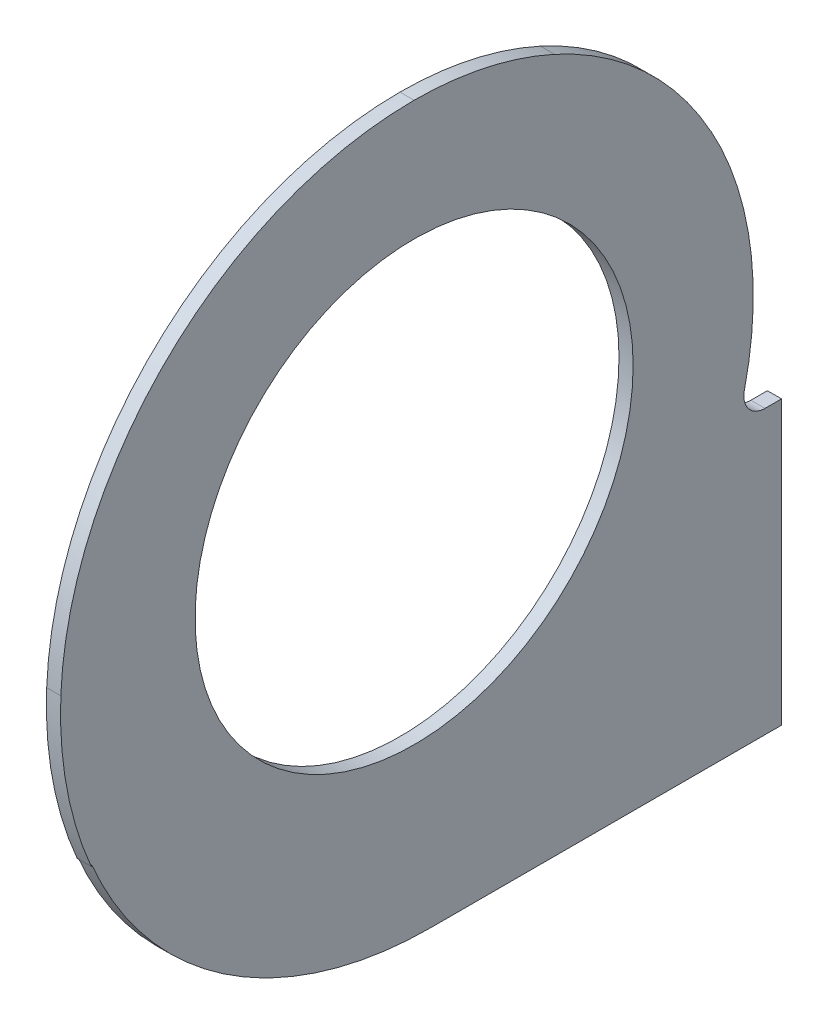
ISO-10303-21;
HEADER;
FILE_DESCRIPTION(('STEP AP214'),'2;1');
FILE_NAME('part.step','',(''),(''),'','','');
FILE_SCHEMA(('AUTOMOTIVE_DESIGN { 1 0 10303 214 1 1 1 1 }'));
ENDSEC;
DATA;
#1=APPLICATION_CONTEXT('core data for automotive mechanical design processes');
#2=APPLICATION_PROTOCOL_DEFINITION('international standard','automotive_design',2000,#1);
#3=PRODUCT_CONTEXT('',#1,'mechanical');
#4=PRODUCT('Part','Part','',(#3));
#5=PRODUCT_RELATED_PRODUCT_CATEGORY('part','',(#4));
#6=PRODUCT_DEFINITION_FORMATION('','',#4);
#7=PRODUCT_DEFINITION_CONTEXT('part definition',#1,'design');
#8=PRODUCT_DEFINITION('design','',#6,#7);
#9=PRODUCT_DEFINITION_SHAPE('','',#8);
#10=(LENGTH_UNIT() NAMED_UNIT(*) SI_UNIT(.MILLI.,.METRE.));
#11=(NAMED_UNIT(*) PLANE_ANGLE_UNIT() SI_UNIT($,.RADIAN.));
#12=(NAMED_UNIT(*) SI_UNIT($,.STERADIAN.) SOLID_ANGLE_UNIT());
#13=UNCERTAINTY_MEASURE_WITH_UNIT(LENGTH_MEASURE(1.E-05),#10,'distance_accuracy_value','');
#14=(GEOMETRIC_REPRESENTATION_CONTEXT(3) GLOBAL_UNCERTAINTY_ASSIGNED_CONTEXT((#13)) GLOBAL_UNIT_ASSIGNED_CONTEXT((#10,
#11,#12)) REPRESENTATION_CONTEXT('',''));
#15=CARTESIAN_POINT('',(0.,0.,0.));
#16=DIRECTION('',(0.,0.,1.));
#17=DIRECTION('',(1.,0.,0.));
#18=AXIS2_PLACEMENT_3D('',#15,#16,#17);
#19=CARTESIAN_POINT('',(0.,0.,-26.));
#20=DIRECTION('',(0.,0.,1.));
#21=DIRECTION('',(0.,-1.,0.));
#22=AXIS2_PLACEMENT_3D('',#19,#20,#21);
#23=PLANE('',#22);
#24=DIRECTION('',(0.,1.,0.));
#25=VECTOR('',#24,1.);
#26=CARTESIAN_POINT('',(13.5,-26.2999999999998,-26.));
#27=LINE('',#26,#25);
#28=CARTESIAN_POINT('',(13.5,-27.2999999999999,-26.));
#29=VERTEX_POINT('',#28);
#30=CARTESIAN_POINT('',(13.5,-7.29999999999976,-26.));
#31=VERTEX_POINT('',#30);
#32=EDGE_CURVE('E311',#29,#31,#27,.T.);
#33=ORIENTED_EDGE('',*,*,#32,.T.);
#34=DIRECTION('',(1.,0.,0.));
#35=VECTOR('',#34,1.);
#36=CARTESIAN_POINT('',(14.5,-7.29999999999976,-26.));
#37=LINE('',#36,#35);
#38=CARTESIAN_POINT('',(14.5,-7.29999999999976,-26.));
#39=VERTEX_POINT('',#38);
#40=EDGE_CURVE('E314',#31,#39,#37,.T.);
#41=ORIENTED_EDGE('',*,*,#40,.T.);
#42=DIRECTION('',(0.,-1.,0.));
#43=VECTOR('',#42,1.);
#44=CARTESIAN_POINT('',(14.5,-27.2999999999998,-25.9999999999999));
#45=LINE('',#44,#43);
#46=CARTESIAN_POINT('',(14.5,-27.2999999999998,-25.9999999999999));
#47=VERTEX_POINT('',#46);
#48=EDGE_CURVE('E317',#39,#47,#45,.T.);
#49=ORIENTED_EDGE('',*,*,#48,.T.);
#50=DIRECTION('',(-1.,0.,0.));
#51=VECTOR('',#50,1.);
#52=CARTESIAN_POINT('',(3.,-27.2999999999998,-25.9999999999999));
#53=LINE('',#52,#51);
#54=EDGE_CURVE('E321',#47,#29,#53,.T.);
#55=ORIENTED_EDGE('',*,*,#54,.T.);
#56=EDGE_LOOP('',(#33,#41,#49,#55));
#57=FACE_BOUND('',#56,.T.);
#58=ADVANCED_FACE('F38',(#57),#23,.F.);
#59=CARTESIAN_POINT('',(3.,-1.07015999999986,-1.20799999999999));
#60=DIRECTION('',(1.,0.,0.));
#61=DIRECTION('',(0.,0.,-1.));
#62=AXIS2_PLACEMENT_3D('',#59,#60,#61);
#63=CYLINDRICAL_SURFACE('',#62,26.22984);
#64=CARTESIAN_POINT('',(14.5,-24.722503320528,10.130922429996));
#65=DIRECTION('',(-1.,0.,0.));
#66=VECTOR('',#65,1.);
#67=LINE('',#64,#66);
#68=CARTESIAN_POINT('',(14.5,-24.7224797385234,10.1308919924631));
#69=VERTEX_POINT('',#68);
#70=CARTESIAN_POINT('',(13.5,-24.7224797385234,10.1308919924631));
#71=VERTEX_POINT('',#70);
#72=EDGE_CURVE('E190',#69,#71,#67,.T.);
#73=ORIENTED_EDGE('',*,*,#72,.T.);
#74=CARTESIAN_POINT('',(13.5,-1.07015999999986,-1.20799999999999));
#75=DIRECTION('',(-1.,0.,0.));
#76=DIRECTION('',(0.,0.,1.));
#77=AXIS2_PLACEMENT_3D('',#74,#75,#76);
#78=CIRCLE('',#77,26.22984);
#79=CARTESIAN_POINT('',(13.5,-27.2999999999999,-1.20799999999976));
#80=VERTEX_POINT('',#79);
#81=EDGE_CURVE('E214',#71,#80,#78,.F.);
#82=ORIENTED_EDGE('',*,*,#81,.T.);
#83=DIRECTION('',(1.,0.,0.));
#84=VECTOR('',#83,1.);
#85=CARTESIAN_POINT('',(3.,-27.2999999999999,-1.208));
#86=LINE('',#85,#84);
#87=CARTESIAN_POINT('',(14.5,-27.2999999999999,-1.208));
#88=VERTEX_POINT('',#87);
#89=EDGE_CURVE('E227',#80,#88,#86,.T.);
#90=ORIENTED_EDGE('',*,*,#89,.T.);
#91=CARTESIAN_POINT('',(14.5,-1.07015999999986,-1.20799999999999));
#92=DIRECTION('',(1.,0.,0.));
#93=DIRECTION('',(0.,0.,-1.));
#94=AXIS2_PLACEMENT_3D('',#91,#92,#93);
#95=CIRCLE('',#94,26.22984);
#96=EDGE_CURVE('E223',#69,#88,#95,.T.);
#97=ORIENTED_EDGE('',*,*,#96,.F.);
#98=EDGE_LOOP('',(#73,#82,#90,#97));
#99=FACE_BOUND('',#98,.T.);
#100=ADVANCED_FACE('F334',(#99),#63,.T.);
#101=CARTESIAN_POINT('',(3.,-1.07015999999986,-1.20799999999999));
#102=DIRECTION('',(1.,0.,0.));
#103=DIRECTION('',(0.,0.,-1.));
#104=AXIS2_PLACEMENT_3D('',#101,#102,#103);
#105=CYLINDRICAL_SURFACE('',#104,26.22984);
#106=DIRECTION('',(1.,0.,0.));
#107=VECTOR('',#106,1.);
#108=CARTESIAN_POINT('',(3.,-11.5328664623184,22.8447811262848));
#109=LINE('',#108,#107);
#110=CARTESIAN_POINT('',(14.5,-11.5328664623184,22.8447811262848));
#111=VERTEX_POINT('',#110);
#112=CARTESIAN_POINT('',(13.5,-11.5328664623184,22.8447811262848));
#113=VERTEX_POINT('',#112);
#114=EDGE_CURVE('E65',#111,#113,#109,.F.);
#115=ORIENTED_EDGE('',*,*,#114,.F.);
#116=CARTESIAN_POINT('',(14.5,-1.07015999999986,-1.20799999999999));
#117=DIRECTION('',(1.,0.,0.));
#118=DIRECTION('',(0.,0.,-1.));
#119=AXIS2_PLACEMENT_3D('',#116,#117,#118);
#120=CIRCLE('',#119,26.22984);
#121=CARTESIAN_POINT('',(14.5,-2.21480819795339E-12,25.0000000000001));
#122=VERTEX_POINT('',#121);
#123=EDGE_CURVE('E247',#122,#111,#120,.T.);
#124=ORIENTED_EDGE('',*,*,#123,.F.);
#125=DIRECTION('',(1.,0.,0.));
#126=VECTOR('',#125,1.);
#127=CARTESIAN_POINT('',(3.,-2.21480819795339E-12,25.0000000000001));
#128=LINE('',#127,#126);
#129=CARTESIAN_POINT('',(13.5,-2.5804011705155E-12,25.));
#130=VERTEX_POINT('',#129);
#131=EDGE_CURVE('E252',#130,#122,#128,.T.);
#132=ORIENTED_EDGE('',*,*,#131,.F.);
#133=CARTESIAN_POINT('',(13.5,-1.07015999999986,-1.20799999999999));
#134=DIRECTION('',(-1.,0.,0.));
#135=DIRECTION('',(0.,0.,1.));
#136=AXIS2_PLACEMENT_3D('',#133,#134,#135);
#137=CIRCLE('',#136,26.22984);
#138=EDGE_CURVE('E211',#130,#113,#137,.F.);
#139=ORIENTED_EDGE('',*,*,#138,.T.);
#140=EDGE_LOOP('',(#115,#124,#132,#139));
#141=FACE_BOUND('',#140,.T.);
#142=ADVANCED_FACE('F365',(#141),#105,.T.);
#143=CARTESIAN_POINT('',(3.,-1.0208333333332,0.));
#144=DIRECTION('',(1.,0.,0.));
#145=DIRECTION('',(0.,0.,-1.));
#146=AXIS2_PLACEMENT_3D('',#143,#144,#145);
#147=CYLINDRICAL_SURFACE('',#146,25.0208333333332);
#148=DIRECTION('',(1.,0.,0.));
#149=VECTOR('',#148,1.);
#150=CARTESIAN_POINT('',(3.,24.,-1.1599694329595E-11));
#151=LINE('',#150,#149);
#152=CARTESIAN_POINT('',(13.5,24.,-1.1599694329595E-11));
#153=VERTEX_POINT('',#152);
#154=CARTESIAN_POINT('',(14.5,24.,-1.1599694329595E-11));
#155=VERTEX_POINT('',#154);
#156=EDGE_CURVE('E251',#153,#155,#151,.T.);
#157=ORIENTED_EDGE('',*,*,#156,.F.);
#158=CARTESIAN_POINT('',(13.5,-1.0208333333332,0.));
#159=DIRECTION('',(-1.,0.,0.));
#160=DIRECTION('',(0.,0.,1.));
#161=AXIS2_PLACEMENT_3D('',#158,#159,#160);
#162=CIRCLE('',#161,25.0208333333332);
#163=EDGE_CURVE('E207',#153,#130,#162,.F.);
#164=ORIENTED_EDGE('',*,*,#163,.T.);
#165=ORIENTED_EDGE('',*,*,#131,.T.);
#166=CARTESIAN_POINT('',(14.5,-1.0208333333332,0.));
#167=DIRECTION('',(1.,0.,0.));
#168=DIRECTION('',(0.,0.,-1.));
#169=AXIS2_PLACEMENT_3D('',#166,#167,#168);
#170=CIRCLE('',#169,25.0208333333332);
#171=EDGE_CURVE('E243',#155,#122,#170,.T.);
#172=ORIENTED_EDGE('',*,*,#171,.F.);
#173=EDGE_LOOP('',(#157,#164,#165,#172));
#174=FACE_BOUND('',#173,.T.);
#175=ADVANCED_FACE('F372',(#174),#147,.T.);
#176=CARTESIAN_POINT('',(3.,0.,0.));
#177=DIRECTION('',(1.,0.,0.));
#178=DIRECTION('',(0.,0.,-1.));
#179=AXIS2_PLACEMENT_3D('',#176,#177,#178);
#180=CYLINDRICAL_SURFACE('',#179,24.);
#181=ORIENTED_EDGE('',*,*,#156,.T.);
#182=CARTESIAN_POINT('',(14.5,0.,0.));
#183=DIRECTION('',(1.,0.,0.));
#184=DIRECTION('',(0.,0.,-1.));
#185=AXIS2_PLACEMENT_3D('',#182,#183,#184);
#186=CIRCLE('',#185,24.);
#187=CARTESIAN_POINT('',(14.4999999999994,21.8442931299568,-9.94116983320001));
#188=VERTEX_POINT('',#187);
#189=EDGE_CURVE('E240',#188,#155,#186,.T.);
#190=ORIENTED_EDGE('',*,*,#189,.F.);
#191=DIRECTION('',(-1.,0.,0.));
#192=VECTOR('',#191,1.);
#193=CARTESIAN_POINT('',(24.5,21.8442931299567,-9.94116983320001));
#194=LINE('',#193,#192);
#195=CARTESIAN_POINT('',(13.5,21.8442931299567,-9.94116983320001));
#196=VERTEX_POINT('',#195);
#197=EDGE_CURVE('E186',#188,#196,#194,.T.);
#198=ORIENTED_EDGE('',*,*,#197,.T.);
#199=CARTESIAN_POINT('',(13.5,0.,0.));
#200=DIRECTION('',(-1.,0.,0.));
#201=DIRECTION('',(0.,0.,1.));
#202=AXIS2_PLACEMENT_3D('',#199,#200,#201);
#203=CIRCLE('',#202,24.);
#204=EDGE_CURVE('E198',#196,#153,#203,.F.);
#205=ORIENTED_EDGE('',*,*,#204,.T.);
#206=EDGE_LOOP('',(#181,#190,#198,#205));
#207=FACE_BOUND('',#206,.T.);
#208=ADVANCED_FACE('F280',(#207),#180,.T.);
#209=CARTESIAN_POINT('',(3.,0.,0.));
#210=DIRECTION('',(1.,0.,0.));
#211=DIRECTION('',(0.,0.,-1.));
#212=AXIS2_PLACEMENT_3D('',#209,#210,#211);
#213=CYLINDRICAL_SURFACE('',#212,24.0000000000004);
#214=DIRECTION('',(1.,0.,0.));
#215=VECTOR('',#214,1.);
#216=CARTESIAN_POINT('',(3.,11.6317938744517,-20.9928885878596));
#217=LINE('',#216,#215);
#218=CARTESIAN_POINT('',(14.5,11.6317938744517,-20.9928885878596));
#219=VERTEX_POINT('',#218);
#220=CARTESIAN_POINT('',(13.5,11.6317938744517,-20.9928885878596));
#221=VERTEX_POINT('',#220);
#222=EDGE_CURVE('E58',#219,#221,#217,.F.);
#223=ORIENTED_EDGE('',*,*,#222,.F.);
#224=CARTESIAN_POINT('',(14.5,0.,0.));
#225=DIRECTION('',(1.,0.,0.));
#226=DIRECTION('',(0.,0.,-1.));
#227=AXIS2_PLACEMENT_3D('',#224,#225,#226);
#228=CIRCLE('',#227,24.0000000000004);
#229=CARTESIAN_POINT('',(14.5,-5.45882352940886,-23.3709487542716));
#230=VERTEX_POINT('',#229);
#231=EDGE_CURVE('E236',#230,#219,#228,.T.);
#232=ORIENTED_EDGE('',*,*,#231,.F.);
#233=DIRECTION('',(1.,0.,0.));
#234=VECTOR('',#233,1.);
#235=CARTESIAN_POINT('',(3.,-5.45882352940886,-23.3709487542716));
#236=LINE('',#235,#234);
#237=CARTESIAN_POINT('',(13.5,-5.45882352940886,-23.3709487542716));
#238=VERTEX_POINT('',#237);
#239=EDGE_CURVE('E261',#230,#238,#236,.F.);
#240=ORIENTED_EDGE('',*,*,#239,.T.);
#241=CARTESIAN_POINT('',(13.5,0.,0.));
#242=DIRECTION('',(-1.,0.,0.));
#243=DIRECTION('',(0.,0.,1.));
#244=AXIS2_PLACEMENT_3D('',#241,#242,#243);
#245=CIRCLE('',#244,24.0000000000004);
#246=EDGE_CURVE('E290',#238,#221,#245,.F.);
#247=ORIENTED_EDGE('',*,*,#246,.T.);
#248=EDGE_LOOP('',(#223,#232,#240,#247));
#249=FACE_BOUND('',#248,.T.);
#250=ADVANCED_FACE('F288',(#249),#213,.T.);
#251=CARTESIAN_POINT('',(3.,-7.2999999999969,-23.9998987972805));
#252=DIRECTION('',(0.,1.,0.));
#253=DIRECTION('',(0.,0.,1.));
#254=AXIS2_PLACEMENT_3D('',#251,#252,#253);
#255=PLANE('',#254);
#256=ORIENTED_EDGE('',*,*,#40,.F.);
#257=DIRECTION('',(0.,0.,1.));
#258=VECTOR('',#257,1.);
#259=CARTESIAN_POINT('',(13.5,-7.2999999999969,-23.9998987972805));
#260=LINE('',#259,#258);
#261=CARTESIAN_POINT('',(13.5,-7.2999999999969,-24.8316330514135));
#262=VERTEX_POINT('',#261);
#263=EDGE_CURVE('E296',#31,#262,#260,.T.);
#264=ORIENTED_EDGE('',*,*,#263,.T.);
#265=DIRECTION('',(-1.,0.,0.));
#266=VECTOR('',#265,1.);
#267=CARTESIAN_POINT('',(14.5,-7.2999999999969,-24.8316330514135));
#268=LINE('',#267,#266);
#269=CARTESIAN_POINT('',(14.5,-7.2999999999969,-24.8316330514135));
#270=VERTEX_POINT('',#269);
#271=EDGE_CURVE('E255',#262,#270,#268,.F.);
#272=ORIENTED_EDGE('',*,*,#271,.T.);
#273=DIRECTION('',(0.,0.,1.));
#274=VECTOR('',#273,1.);
#275=CARTESIAN_POINT('',(14.5,-7.2999999999969,-23.9998987972805));
#276=LINE('',#275,#274);
#277=EDGE_CURVE('E226',#39,#270,#276,.T.);
#278=ORIENTED_EDGE('',*,*,#277,.F.);
#279=EDGE_LOOP('',(#256,#264,#272,#278));
#280=FACE_BOUND('',#279,.T.);
#281=ADVANCED_FACE('F345',(#280),#255,.T.);
#282=CARTESIAN_POINT('',(3.,-27.2999999999999,-1.208));
#283=DIRECTION('',(0.,-1.,0.));
#284=DIRECTION('',(0.,0.,-1.));
#285=AXIS2_PLACEMENT_3D('',#282,#283,#284);
#286=PLANE('',#285);
#287=ORIENTED_EDGE('',*,*,#89,.F.);
#288=DIRECTION('',(0.,0.,-1.));
#289=VECTOR('',#288,1.);
#290=CARTESIAN_POINT('',(13.5,-27.2999999999999,-1.208));
#291=LINE('',#290,#289);
#292=EDGE_CURVE('E217',#80,#29,#291,.T.);
#293=ORIENTED_EDGE('',*,*,#292,.T.);
#294=ORIENTED_EDGE('',*,*,#54,.F.);
#295=DIRECTION('',(0.,0.,-1.));
#296=VECTOR('',#295,1.);
#297=CARTESIAN_POINT('',(14.5,-27.2999999999999,-1.208));
#298=LINE('',#297,#296);
#299=EDGE_CURVE('E324',#88,#47,#298,.T.);
#300=ORIENTED_EDGE('',*,*,#299,.F.);
#301=EDGE_LOOP('',(#287,#293,#294,#300));
#302=FACE_BOUND('',#301,.T.);
#303=ADVANCED_FACE('F338',(#302),#286,.T.);
#304=CARTESIAN_POINT('',(3.,-5.79999999999691,-24.8316330514135));
#305=DIRECTION('',(1.,0.,0.));
#306=DIRECTION('',(0.,0.,-1.));
#307=AXIS2_PLACEMENT_3D('',#304,#305,#306);
#308=CYLINDRICAL_SURFACE('',#307,1.49999999999999);
#309=CARTESIAN_POINT('',(13.5,-5.79999999999691,-24.8316330514135));
#310=DIRECTION('',(-1.,0.,0.));
#311=DIRECTION('',(0.,0.,1.));
#312=AXIS2_PLACEMENT_3D('',#309,#310,#311);
#313=CIRCLE('',#312,1.49999999999999);
#314=EDGE_CURVE('E293',#238,#262,#313,.F.);
#315=ORIENTED_EDGE('',*,*,#314,.F.);
#316=ORIENTED_EDGE('',*,*,#239,.F.);
#317=CARTESIAN_POINT('',(14.5,-5.79999999999691,-24.8316330514135));
#318=DIRECTION('',(1.,0.,0.));
#319=DIRECTION('',(0.,0.,-1.));
#320=AXIS2_PLACEMENT_3D('',#317,#318,#319);
#321=CIRCLE('',#320,1.49999999999999);
#322=EDGE_CURVE('E265',#270,#230,#321,.F.);
#323=ORIENTED_EDGE('',*,*,#322,.F.);
#324=ORIENTED_EDGE('',*,*,#271,.F.);
#325=EDGE_LOOP('',(#315,#316,#323,#324));
#326=FACE_BOUND('',#325,.T.);
#327=ADVANCED_FACE('F40',(#326),#308,.F.);
#328=CARTESIAN_POINT('',(14.5,-1.07015999999986,-1.20799999999999));
#329=DIRECTION('',(1.,0.,0.));
#330=DIRECTION('',(0.,0.,-1.));
#331=AXIS2_PLACEMENT_3D('',#328,#329,#330);
#332=PLANE('',#331);
#333=DIRECTION('',(0.,-0.965214128779373,0.261460676975861));
#334=VECTOR('',#333,1.);
#335=CARTESIAN_POINT('',(14.5,4.28468483655705,18.560065903628));
#336=LINE('',#335,#334);
#337=CARTESIAN_POINT('',(14.5,-11.4351128921148,22.8183012873763));
#338=VERTEX_POINT('',#337);
#339=EDGE_CURVE('E191',#338,#111,#336,.T.);
#340=ORIENTED_EDGE('',*,*,#339,.F.);
#341=CARTESIAN_POINT('',(14.5,-1.31140416343335,-1.08561537175225));
#342=DIRECTION('',(1.,0.,0.));
#343=DIRECTION('',(0.,0.,-1.));
#344=AXIS2_PLACEMENT_3D('',#341,#342,#343);
#345=CIRCLE('',#344,25.959327997268);
#346=CARTESIAN_POINT('',(14.4999999999998,-24.4620825168871,10.6588642610229));
#347=VERTEX_POINT('',#346);
#348=EDGE_CURVE('E150',#347,#338,#345,.F.);
#349=ORIENTED_EDGE('',*,*,#348,.F.);
#350=CARTESIAN_POINT('',(14.5,-1.31140416343335,-1.08561537175225));
#351=DIRECTION('',(-1.,0.,0.));
#352=DIRECTION('',(0.,-0.901835825470872,0.432078863053114));
#353=AXIS2_PLACEMENT_3D('',#350,#351,#352);
#354=CIRCLE('',#353,25.959327997268);
#355=EDGE_CURVE('E195',#69,#347,#354,.T.);
#356=ORIENTED_EDGE('',*,*,#355,.F.);
#357=ORIENTED_EDGE('',*,*,#96,.T.);
#358=ORIENTED_EDGE('',*,*,#299,.T.);
#359=ORIENTED_EDGE('',*,*,#48,.F.);
#360=ORIENTED_EDGE('',*,*,#277,.T.);
#361=ORIENTED_EDGE('',*,*,#322,.T.);
#362=ORIENTED_EDGE('',*,*,#231,.T.);
#363=DIRECTION('',(0.,0.85679364152041,-0.515659437856223));
#364=VECTOR('',#363,1.);
#365=CARTESIAN_POINT('',(14.5,-6.4338867024575,-10.1200970084917));
#366=LINE('',#365,#364);
#367=CARTESIAN_POINT('',(14.5,11.6184009613264,-20.9848280914708));
#368=VERTEX_POINT('',#367);
#369=EDGE_CURVE('E153',#368,#219,#366,.T.);
#370=ORIENTED_EDGE('',*,*,#369,.F.);
#371=CARTESIAN_POINT('',(14.5,0.0624757737328525,-0.0284322442224686));
#372=DIRECTION('',(1.,0.,0.));
#373=DIRECTION('',(0.,0.,-1.));
#374=AXIS2_PLACEMENT_3D('',#371,#372,#373);
#375=CIRCLE('',#374,23.931358796521);
#376=EDGE_CURVE('E183',#188,#368,#375,.F.);
#377=ORIENTED_EDGE('',*,*,#376,.F.);
#378=ORIENTED_EDGE('',*,*,#189,.T.);
#379=ORIENTED_EDGE('',*,*,#171,.T.);
#380=ORIENTED_EDGE('',*,*,#123,.T.);
#381=EDGE_LOOP('',(#340,#349,#356,#357,#358,#359,#360,#361,#362,#370,#377,#378,#379,#380));
#382=FACE_BOUND('',#381,.T.);
#383=CARTESIAN_POINT('',(14.5,0.,0.));
#384=DIRECTION('',(1.,0.,0.));
#385=DIRECTION('',(0.,0.,-1.));
#386=AXIS2_PLACEMENT_3D('',#383,#384,#385);
#387=CIRCLE('',#386,15.5);
#388=CARTESIAN_POINT('',(14.5,0.,-15.5));
#389=VERTEX_POINT('',#388);
#390=EDGE_CURVE('E303',#389,#389,#387,.T.);
#391=ORIENTED_EDGE('',*,*,#390,.F.);
#392=EDGE_LOOP('',(#391));
#393=FACE_BOUND('',#392,.T.);
#394=ADVANCED_FACE('F284',(#382,#393),#332,.T.);
#395=CARTESIAN_POINT('',(13.5,0.,0.));
#396=DIRECTION('',(-1.,0.,0.));
#397=DIRECTION('',(0.,0.,1.));
#398=AXIS2_PLACEMENT_3D('',#395,#396,#397);
#399=PLANE('',#398);
#400=DIRECTION('',(0.,0.965214128779373,-0.261460676975861));
#401=VECTOR('',#400,1.);
#402=CARTESIAN_POINT('',(13.5,4.97682932332917,18.3725753140472));
#403=LINE('',#402,#401);
#404=CARTESIAN_POINT('',(13.5,-11.4351128921148,22.8183012873763));
#405=VERTEX_POINT('',#404);
#406=EDGE_CURVE('E11',#113,#405,#403,.T.);
#407=ORIENTED_EDGE('',*,*,#406,.F.);
#408=ORIENTED_EDGE('',*,*,#138,.F.);
#409=ORIENTED_EDGE('',*,*,#163,.F.);
#410=ORIENTED_EDGE('',*,*,#204,.F.);
#411=CARTESIAN_POINT('',(13.5,0.0624757737328525,-0.0284322442224686));
#412=DIRECTION('',(1.,0.,0.));
#413=DIRECTION('',(0.,0.,1.));
#414=AXIS2_PLACEMENT_3D('',#411,#412,#413);
#415=CIRCLE('',#414,23.931358796521);
#416=CARTESIAN_POINT('',(13.5,11.6184009613264,-20.9848280914708));
#417=VERTEX_POINT('',#416);
#418=EDGE_CURVE('E167',#417,#196,#415,.T.);
#419=ORIENTED_EDGE('',*,*,#418,.F.);
#420=DIRECTION('',(0.,-0.85679364152041,0.515659437856223));
#421=VECTOR('',#420,1.);
#422=CARTESIAN_POINT('',(13.5,-6.18199821183683,-10.2716955628943));
#423=LINE('',#422,#421);
#424=EDGE_CURVE('E50',#221,#417,#423,.T.);
#425=ORIENTED_EDGE('',*,*,#424,.F.);
#426=ORIENTED_EDGE('',*,*,#246,.F.);
#427=ORIENTED_EDGE('',*,*,#314,.T.);
#428=ORIENTED_EDGE('',*,*,#263,.F.);
#429=ORIENTED_EDGE('',*,*,#32,.F.);
#430=ORIENTED_EDGE('',*,*,#292,.F.);
#431=ORIENTED_EDGE('',*,*,#81,.F.);
#432=CARTESIAN_POINT('',(13.5,-1.31140416343335,-1.08561537175225));
#433=DIRECTION('',(1.,0.,0.));
#434=DIRECTION('',(0.,-0.891805764613404,0.452418476857767));
#435=AXIS2_PLACEMENT_3D('',#432,#433,#434);
#436=CIRCLE('',#435,25.959327997268);
#437=CARTESIAN_POINT('',(13.5,-24.4620825168871,10.6588642610229));
#438=VERTEX_POINT('',#437);
#439=EDGE_CURVE('E161',#438,#71,#436,.T.);
#440=ORIENTED_EDGE('',*,*,#439,.F.);
#441=CARTESIAN_POINT('',(13.5,-1.31140416343335,-1.08561537175225));
#442=DIRECTION('',(1.,0.,0.));
#443=DIRECTION('',(0.,0.,1.));
#444=AXIS2_PLACEMENT_3D('',#441,#442,#443);
#445=CIRCLE('',#444,25.959327997268);
#446=EDGE_CURVE('E147',#405,#438,#445,.T.);
#447=ORIENTED_EDGE('',*,*,#446,.F.);
#448=EDGE_LOOP('',(#407,#408,#409,#410,#419,#425,#426,#427,#428,#429,#430,#431,#440,#447));
#449=FACE_BOUND('',#448,.T.);
#450=CARTESIAN_POINT('',(13.5,0.,0.));
#451=DIRECTION('',(-1.,0.,0.));
#452=DIRECTION('',(0.,0.,1.));
#453=AXIS2_PLACEMENT_3D('',#450,#451,#452);
#454=CIRCLE('',#453,15.5);
#455=CARTESIAN_POINT('',(13.5,0.,15.5));
#456=VERTEX_POINT('',#455);
#457=EDGE_CURVE('E307',#456,#456,#454,.T.);
#458=ORIENTED_EDGE('',*,*,#457,.F.);
#459=EDGE_LOOP('',(#458));
#460=FACE_BOUND('',#459,.T.);
#461=ADVANCED_FACE('F158',(#449,#460),#399,.T.);
#462=CARTESIAN_POINT('',(14.5,0.,0.));
#463=DIRECTION('',(1.,0.,0.));
#464=DIRECTION('',(0.,0.,-1.));
#465=AXIS2_PLACEMENT_3D('',#462,#463,#464);
#466=CYLINDRICAL_SURFACE('',#465,15.5);
#467=ORIENTED_EDGE('',*,*,#390,.T.);
#468=EDGE_LOOP('',(#467));
#469=FACE_BOUND('',#468,.T.);
#470=ORIENTED_EDGE('',*,*,#457,.T.);
#471=EDGE_LOOP('',(#470));
#472=FACE_BOUND('',#471,.T.);
#473=ADVANCED_FACE('F387',(#469,#472),#466,.F.);
#474=CARTESIAN_POINT('',(35.5,0.0624757737328525,-0.0284322442224686));
#475=DIRECTION('',(-1.,0.,0.));
#476=DIRECTION('',(0.,0.,1.));
#477=AXIS2_PLACEMENT_3D('',#474,#475,#476);
#478=CYLINDRICAL_SURFACE('',#477,23.931358796521);
#479=ORIENTED_EDGE('',*,*,#376,.T.);
#480=DIRECTION('',(-1.,0.,0.));
#481=VECTOR('',#480,1.);
#482=CARTESIAN_POINT('',(35.5,11.6184009613264,-20.9848280914708));
#483=LINE('',#482,#481);
#484=EDGE_CURVE('E164',#368,#417,#483,.T.);
#485=ORIENTED_EDGE('',*,*,#484,.T.);
#486=ORIENTED_EDGE('',*,*,#418,.T.);
#487=ORIENTED_EDGE('',*,*,#197,.F.);
#488=EDGE_LOOP('',(#479,#485,#486,#487));
#489=FACE_BOUND('',#488,.T.);
#490=ADVANCED_FACE('F276',(#489),#478,.T.);
#491=CARTESIAN_POINT('',(35.5,18.8929795022648,-25.3630177736498));
#492=DIRECTION('',(0.,-0.515659437856223,-0.85679364152041));
#493=DIRECTION('',(0.,0.85679364152041,-0.515659437856223));
#494=AXIS2_PLACEMENT_3D('',#491,#492,#493);
#495=PLANE('',#494);
#496=ORIENTED_EDGE('',*,*,#222,.T.);
#497=ORIENTED_EDGE('',*,*,#424,.T.);
#498=ORIENTED_EDGE('',*,*,#484,.F.);
#499=ORIENTED_EDGE('',*,*,#369,.T.);
#500=EDGE_LOOP('',(#496,#497,#498,#499));
#501=FACE_BOUND('',#500,.T.);
#502=ADVANCED_FACE('F270',(#501),#495,.F.);
#503=CARTESIAN_POINT('',(35.5,-1.31140416343335,-1.08561537175225));
#504=DIRECTION('',(-1.,0.,0.));
#505=DIRECTION('',(0.,0.,1.));
#506=AXIS2_PLACEMENT_3D('',#503,#504,#505);
#507=CYLINDRICAL_SURFACE('',#506,25.959327997268);
#508=ORIENTED_EDGE('',*,*,#348,.T.);
#509=DIRECTION('',(-1.,0.,0.));
#510=VECTOR('',#509,1.);
#511=CARTESIAN_POINT('',(35.5,-11.4351128921148,22.8183012873763));
#512=LINE('',#511,#510);
#513=EDGE_CURVE('E144',#338,#405,#512,.T.);
#514=ORIENTED_EDGE('',*,*,#513,.T.);
#515=ORIENTED_EDGE('',*,*,#446,.T.);
#516=ORIENTED_EDGE('',*,*,#439,.T.);
#517=ORIENTED_EDGE('',*,*,#72,.F.);
#518=ORIENTED_EDGE('',*,*,#355,.T.);
#519=EDGE_LOOP('',(#508,#514,#515,#516,#517,#518));
#520=FACE_BOUND('',#519,.T.);
#521=ADVANCED_FACE('F145',(#520),#507,.T.);
#522=CARTESIAN_POINT('',(35.5,-11.4351128921148,22.8183012873763));
#523=DIRECTION('',(0.,0.261460676975861,0.965214128779373));
#524=DIRECTION('',(0.,-0.965214128779373,0.261460676975861));
#525=AXIS2_PLACEMENT_3D('',#522,#523,#524);
#526=PLANE('',#525);
#527=ORIENTED_EDGE('',*,*,#114,.T.);
#528=ORIENTED_EDGE('',*,*,#406,.T.);
#529=ORIENTED_EDGE('',*,*,#513,.F.);
#530=ORIENTED_EDGE('',*,*,#339,.T.);
#531=EDGE_LOOP('',(#527,#528,#529,#530));
#532=FACE_BOUND('',#531,.T.);
#533=ADVANCED_FACE('F155',(#532),#526,.F.);
#534=CLOSED_SHELL('',(#58,#100,#142,#175,#208,#250,#281,#303,#327,#394,#461,#473,#490,#502,#521,#533));
#535=MANIFOLD_SOLID_BREP('B2',#534);
#536=ADVANCED_BREP_SHAPE_REPRESENTATION('',(#18,#535),#14);
#537=SHAPE_DEFINITION_REPRESENTATION(#9,#536);
ENDSEC;
END-ISO-10303-21;
